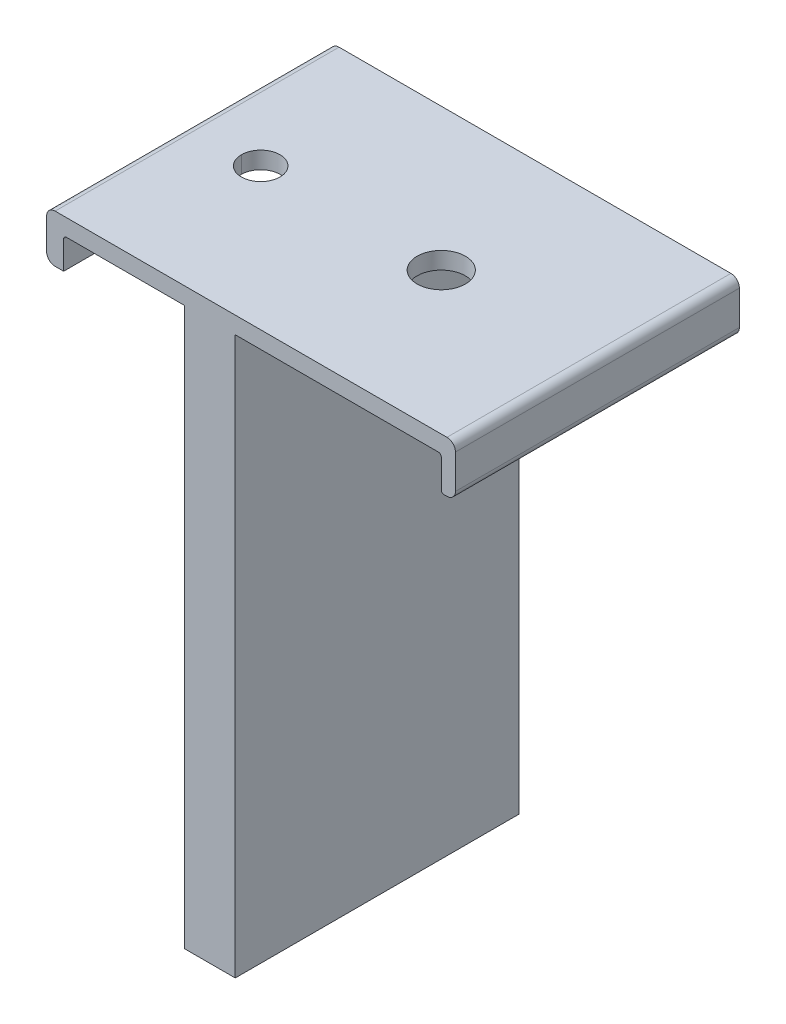
ISO-10303-21;
HEADER;
FILE_DESCRIPTION(('STEP AP214'),'2;1');
FILE_NAME('part.step','',(''),(''),'','','');
FILE_SCHEMA(('AUTOMOTIVE_DESIGN { 1 0 10303 214 1 1 1 1 }'));
ENDSEC;
DATA;
#1=APPLICATION_CONTEXT('core data for automotive mechanical design processes');
#2=APPLICATION_PROTOCOL_DEFINITION('international standard','automotive_design',2000,#1);
#3=PRODUCT_CONTEXT('',#1,'mechanical');
#4=PRODUCT('Part','Part','',(#3));
#5=PRODUCT_RELATED_PRODUCT_CATEGORY('part','',(#4));
#6=PRODUCT_DEFINITION_FORMATION('','',#4);
#7=PRODUCT_DEFINITION_CONTEXT('part definition',#1,'design');
#8=PRODUCT_DEFINITION('design','',#6,#7);
#9=PRODUCT_DEFINITION_SHAPE('','',#8);
#10=(LENGTH_UNIT() NAMED_UNIT(*) SI_UNIT(.MILLI.,.METRE.));
#11=(NAMED_UNIT(*) PLANE_ANGLE_UNIT() SI_UNIT($,.RADIAN.));
#12=(NAMED_UNIT(*) SI_UNIT($,.STERADIAN.) SOLID_ANGLE_UNIT());
#13=UNCERTAINTY_MEASURE_WITH_UNIT(LENGTH_MEASURE(1.E-05),#10,'distance_accuracy_value','');
#14=(GEOMETRIC_REPRESENTATION_CONTEXT(3) GLOBAL_UNCERTAINTY_ASSIGNED_CONTEXT((#13)) GLOBAL_UNIT_ASSIGNED_CONTEXT((#10,
#11,#12)) REPRESENTATION_CONTEXT('',''));
#15=CARTESIAN_POINT('',(0.,0.,0.));
#16=DIRECTION('',(0.,0.,1.));
#17=DIRECTION('',(1.,0.,0.));
#18=AXIS2_PLACEMENT_3D('',#15,#16,#17);
#19=CARTESIAN_POINT('',(0.520000000000034,-53.86,-25.));
#20=DIRECTION('',(1.,0.,0.));
#21=DIRECTION('',(0.,0.,-1.));
#22=AXIS2_PLACEMENT_3D('',#19,#20,#21);
#23=PLANE('',#22);
#24=DIRECTION('',(0.,1.,0.));
#25=VECTOR('',#24,1.);
#26=CARTESIAN_POINT('',(0.520000000000034,-53.86,-25.));
#27=LINE('',#26,#25);
#28=CARTESIAN_POINT('',(0.520000000000034,-98.1,-25.));
#29=VERTEX_POINT('',#28);
#30=CARTESIAN_POINT('',(0.520000000000034,0.,-25.));
#31=VERTEX_POINT('',#30);
#32=EDGE_CURVE('E167',#29,#31,#27,.T.);
#33=ORIENTED_EDGE('',*,*,#32,.T.);
#34=DIRECTION('',(0.,0.,1.));
#35=VECTOR('',#34,1.);
#36=CARTESIAN_POINT('',(0.520000000000034,0.,-25.));
#37=LINE('',#36,#35);
#38=CARTESIAN_POINT('',(0.520000000000034,0.,25.));
#39=VERTEX_POINT('',#38);
#40=EDGE_CURVE('E336',#31,#39,#37,.T.);
#41=ORIENTED_EDGE('',*,*,#40,.T.);
#42=DIRECTION('',(0.,1.,0.));
#43=VECTOR('',#42,1.);
#44=CARTESIAN_POINT('',(0.520000000000034,-53.86,25.));
#45=LINE('',#44,#43);
#46=CARTESIAN_POINT('',(0.520000000000034,-98.1,25.));
#47=VERTEX_POINT('',#46);
#48=EDGE_CURVE('E31',#39,#47,#45,.F.);
#49=ORIENTED_EDGE('',*,*,#48,.T.);
#50=DIRECTION('',(0.,0.,1.));
#51=VECTOR('',#50,1.);
#52=CARTESIAN_POINT('',(0.520000000000034,-98.1,-25.));
#53=LINE('',#52,#51);
#54=EDGE_CURVE('E573',#29,#47,#53,.T.);
#55=ORIENTED_EDGE('',*,*,#54,.F.);
#56=EDGE_LOOP('',(#33,#41,#49,#55));
#57=FACE_BOUND('',#56,.T.);
#58=ADVANCED_FACE('F15',(#57),#23,.T.);
#59=CARTESIAN_POINT('',(-8.45,-71.25,25.));
#60=DIRECTION('',(-1.,0.,0.));
#61=DIRECTION('',(0.,0.,1.));
#62=AXIS2_PLACEMENT_3D('',#59,#60,#61);
#63=PLANE('',#62);
#64=DIRECTION('',(0.,1.,0.));
#65=VECTOR('',#64,1.);
#66=CARTESIAN_POINT('',(-8.45,-71.25,25.));
#67=LINE('',#66,#65);
#68=CARTESIAN_POINT('',(-8.45,-98.1,25.));
#69=VERTEX_POINT('',#68);
#70=CARTESIAN_POINT('',(-8.45,0.,25.));
#71=VERTEX_POINT('',#70);
#72=EDGE_CURVE('E147',#69,#71,#67,.T.);
#73=ORIENTED_EDGE('',*,*,#72,.T.);
#74=DIRECTION('',(0.,0.,1.));
#75=VECTOR('',#74,1.);
#76=CARTESIAN_POINT('',(-8.45,0.,-25.));
#77=LINE('',#76,#75);
#78=CARTESIAN_POINT('',(-8.45,0.,-25.));
#79=VERTEX_POINT('',#78);
#80=EDGE_CURVE('E331',#79,#71,#77,.T.);
#81=ORIENTED_EDGE('',*,*,#80,.F.);
#82=DIRECTION('',(0.,1.,0.));
#83=VECTOR('',#82,1.);
#84=CARTESIAN_POINT('',(-8.45,-71.25,-25.));
#85=LINE('',#84,#83);
#86=CARTESIAN_POINT('',(-8.45,-98.1,-25.));
#87=VERTEX_POINT('',#86);
#88=EDGE_CURVE('E164',#79,#87,#85,.F.);
#89=ORIENTED_EDGE('',*,*,#88,.T.);
#90=DIRECTION('',(0.,0.,1.));
#91=VECTOR('',#90,1.);
#92=CARTESIAN_POINT('',(-8.45,-98.1,-25.));
#93=LINE('',#92,#91);
#94=EDGE_CURVE('E339',#87,#69,#93,.T.);
#95=ORIENTED_EDGE('',*,*,#94,.T.);
#96=EDGE_LOOP('',(#73,#81,#89,#95));
#97=FACE_BOUND('',#96,.T.);
#98=ADVANCED_FACE('F550',(#97),#63,.T.);
#99=CARTESIAN_POINT('',(37.3,-5.5,25.20937806158));
#100=DIRECTION('',(0.,0.,-1.));
#101=DIRECTION('',(-1.,0.,0.));
#102=AXIS2_PLACEMENT_3D('',#99,#100,#101);
#103=CYLINDRICAL_SURFACE('',#102,0.5);
#104=CARTESIAN_POINT('',(37.3,-5.5,25.));
#105=DIRECTION('',(0.,0.,-1.));
#106=DIRECTION('',(-1.,0.,0.));
#107=AXIS2_PLACEMENT_3D('',#104,#105,#106);
#108=CIRCLE('',#107,0.5);
#109=CARTESIAN_POINT('',(37.3,-5.99999999999978,25.));
#110=VERTEX_POINT('',#109);
#111=CARTESIAN_POINT('',(36.8,-5.5,25.));
#112=VERTEX_POINT('',#111);
#113=EDGE_CURVE('E146',#110,#112,#108,.T.);
#114=ORIENTED_EDGE('',*,*,#113,.T.);
#115=DIRECTION('',(0.,0.,1.));
#116=VECTOR('',#115,1.);
#117=CARTESIAN_POINT('',(36.8,-5.5,-25.));
#118=LINE('',#117,#116);
#119=CARTESIAN_POINT('',(36.8,-5.5,-25.));
#120=VERTEX_POINT('',#119);
#121=EDGE_CURVE('E142',#120,#112,#118,.T.);
#122=ORIENTED_EDGE('',*,*,#121,.F.);
#123=CARTESIAN_POINT('',(37.3,-5.5,-25.));
#124=DIRECTION('',(0.,0.,-1.));
#125=DIRECTION('',(-1.,0.,0.));
#126=AXIS2_PLACEMENT_3D('',#123,#124,#125);
#127=CIRCLE('',#126,0.5);
#128=CARTESIAN_POINT('',(37.3,-5.99999999999978,-25.));
#129=VERTEX_POINT('',#128);
#130=EDGE_CURVE('E18',#120,#129,#127,.F.);
#131=ORIENTED_EDGE('',*,*,#130,.T.);
#132=DIRECTION('',(0.,0.,-1.));
#133=VECTOR('',#132,1.);
#134=CARTESIAN_POINT('',(37.3,-5.99999999999978,-25.));
#135=LINE('',#134,#133);
#136=EDGE_CURVE('E139',#110,#129,#135,.T.);
#137=ORIENTED_EDGE('',*,*,#136,.F.);
#138=EDGE_LOOP('',(#114,#122,#131,#137));
#139=FACE_BOUND('',#138,.T.);
#140=ADVANCED_FACE('F137',(#139),#103,.T.);
#141=CARTESIAN_POINT('',(36.8,-5.99999999999978,-25.));
#142=DIRECTION('',(0.,-1.,0.));
#143=DIRECTION('',(0.,0.,-1.));
#144=AXIS2_PLACEMENT_3D('',#141,#142,#143);
#145=PLANE('',#144);
#146=DIRECTION('',(1.,0.,0.));
#147=VECTOR('',#146,1.);
#148=CARTESIAN_POINT('',(36.8,-5.99999999999978,-25.));
#149=LINE('',#148,#147);
#150=CARTESIAN_POINT('',(37.8,-5.99999999999978,-25.));
#151=VERTEX_POINT('',#150);
#152=EDGE_CURVE('E149',#129,#151,#149,.T.);
#153=ORIENTED_EDGE('',*,*,#152,.T.);
#154=DIRECTION('',(0.,0.,-1.));
#155=VECTOR('',#154,1.);
#156=CARTESIAN_POINT('',(37.8,-5.99999999999978,25.20937806158));
#157=LINE('',#156,#155);
#158=CARTESIAN_POINT('',(37.8,-5.99999999999978,25.));
#159=VERTEX_POINT('',#158);
#160=EDGE_CURVE('E227',#159,#151,#157,.T.);
#161=ORIENTED_EDGE('',*,*,#160,.F.);
#162=DIRECTION('',(1.,0.,0.));
#163=VECTOR('',#162,1.);
#164=CARTESIAN_POINT('',(36.8,-5.99999999999978,25.));
#165=LINE('',#164,#163);
#166=EDGE_CURVE('E160',#159,#110,#165,.F.);
#167=ORIENTED_EDGE('',*,*,#166,.T.);
#168=ORIENTED_EDGE('',*,*,#136,.T.);
#169=EDGE_LOOP('',(#153,#161,#167,#168));
#170=FACE_BOUND('',#169,.T.);
#171=ADVANCED_FACE('F159',(#170),#145,.T.);
#172=CARTESIAN_POINT('',(36.3,-0.499999999999723,-25.17890263514));
#173=DIRECTION('',(0.,0.,1.));
#174=DIRECTION('',(1.,0.,0.));
#175=AXIS2_PLACEMENT_3D('',#172,#173,#174);
#176=CYLINDRICAL_SURFACE('',#175,0.5);
#177=DIRECTION('',(0.,0.,-1.));
#178=VECTOR('',#177,1.);
#179=CARTESIAN_POINT('',(36.3,0.,-25.));
#180=LINE('',#179,#178);
#181=CARTESIAN_POINT('',(36.3,0.,-25.));
#182=VERTEX_POINT('',#181);
#183=CARTESIAN_POINT('',(36.3,0.,25.));
#184=VERTEX_POINT('',#183);
#185=EDGE_CURVE('E285',#182,#184,#180,.F.);
#186=ORIENTED_EDGE('',*,*,#185,.F.);
#187=CARTESIAN_POINT('',(36.3,-0.499999999999723,-25.));
#188=DIRECTION('',(0.,0.,1.));
#189=DIRECTION('',(1.,0.,0.));
#190=AXIS2_PLACEMENT_3D('',#187,#188,#189);
#191=CIRCLE('',#190,0.5);
#192=CARTESIAN_POINT('',(36.8,-0.499999999999723,-25.));
#193=VERTEX_POINT('',#192);
#194=EDGE_CURVE('E157',#193,#182,#191,.T.);
#195=ORIENTED_EDGE('',*,*,#194,.F.);
#196=DIRECTION('',(0.,0.,1.));
#197=VECTOR('',#196,1.);
#198=CARTESIAN_POINT('',(36.8,-0.499999999999723,-25.));
#199=LINE('',#198,#197);
#200=CARTESIAN_POINT('',(36.8,-0.499999999999723,25.));
#201=VERTEX_POINT('',#200);
#202=EDGE_CURVE('E228',#201,#193,#199,.F.);
#203=ORIENTED_EDGE('',*,*,#202,.F.);
#204=CARTESIAN_POINT('',(36.3,-0.499999999999723,25.));
#205=DIRECTION('',(0.,0.,1.));
#206=DIRECTION('',(1.,0.,0.));
#207=AXIS2_PLACEMENT_3D('',#204,#205,#206);
#208=CIRCLE('',#207,0.5);
#209=EDGE_CURVE('E219',#184,#201,#208,.F.);
#210=ORIENTED_EDGE('',*,*,#209,.F.);
#211=EDGE_LOOP('',(#186,#195,#203,#210));
#212=FACE_BOUND('',#211,.T.);
#213=ADVANCED_FACE('F524',(#212),#176,.F.);
#214=CARTESIAN_POINT('',(-29.2,-0.500000000000167,-25.17890263514));
#215=DIRECTION('',(0.,0.,1.));
#216=DIRECTION('',(1.,0.,0.));
#217=AXIS2_PLACEMENT_3D('',#214,#215,#216);
#218=CYLINDRICAL_SURFACE('',#217,0.5);
#219=DIRECTION('',(0.,0.,-1.));
#220=VECTOR('',#219,1.);
#221=CARTESIAN_POINT('',(-29.7,-0.500000000000167,-25.));
#222=LINE('',#221,#220);
#223=CARTESIAN_POINT('',(-29.7,-0.500000000000167,-25.));
#224=VERTEX_POINT('',#223);
#225=CARTESIAN_POINT('',(-29.7,-0.500000000000167,25.));
#226=VERTEX_POINT('',#225);
#227=EDGE_CURVE('E215',#224,#226,#222,.F.);
#228=ORIENTED_EDGE('',*,*,#227,.F.);
#229=CARTESIAN_POINT('',(-29.2,-0.500000000000167,-25.));
#230=DIRECTION('',(0.,0.,1.));
#231=DIRECTION('',(1.,0.,0.));
#232=AXIS2_PLACEMENT_3D('',#229,#230,#231);
#233=CIRCLE('',#232,0.5);
#234=CARTESIAN_POINT('',(-29.2,0.,-25.));
#235=VERTEX_POINT('',#234);
#236=EDGE_CURVE('E216',#235,#224,#233,.T.);
#237=ORIENTED_EDGE('',*,*,#236,.F.);
#238=DIRECTION('',(0.,0.,-1.));
#239=VECTOR('',#238,1.);
#240=CARTESIAN_POINT('',(-29.2,0.,-25.));
#241=LINE('',#240,#239);
#242=CARTESIAN_POINT('',(-29.2,0.,25.));
#243=VERTEX_POINT('',#242);
#244=EDGE_CURVE('E272',#243,#235,#241,.T.);
#245=ORIENTED_EDGE('',*,*,#244,.F.);
#246=CARTESIAN_POINT('',(-29.2,-0.500000000000167,25.));
#247=DIRECTION('',(0.,0.,1.));
#248=DIRECTION('',(1.,0.,0.));
#249=AXIS2_PLACEMENT_3D('',#246,#247,#248);
#250=CIRCLE('',#249,0.5);
#251=EDGE_CURVE('E213',#226,#243,#250,.F.);
#252=ORIENTED_EDGE('',*,*,#251,.F.);
#253=EDGE_LOOP('',(#228,#237,#245,#252));
#254=FACE_BOUND('',#253,.T.);
#255=ADVANCED_FACE('F303',(#254),#218,.F.);
#256=CARTESIAN_POINT('',(-29.7,-2.80000000000013,-25.));
#257=DIRECTION('',(1.,0.,0.));
#258=DIRECTION('',(0.,0.,-1.));
#259=AXIS2_PLACEMENT_3D('',#256,#257,#258);
#260=PLANE('',#259);
#261=ORIENTED_EDGE('',*,*,#227,.T.);
#262=DIRECTION('',(0.,1.,0.));
#263=VECTOR('',#262,1.);
#264=CARTESIAN_POINT('',(-29.7,0.,25.));
#265=LINE('',#264,#263);
#266=CARTESIAN_POINT('',(-29.7,-5.43,25.));
#267=VERTEX_POINT('',#266);
#268=EDGE_CURVE('E244',#267,#226,#265,.T.);
#269=ORIENTED_EDGE('',*,*,#268,.F.);
#270=DIRECTION('',(0.,0.,-1.));
#271=VECTOR('',#270,1.);
#272=CARTESIAN_POINT('',(-29.7,-5.43,-25.));
#273=LINE('',#272,#271);
#274=CARTESIAN_POINT('',(-29.7,-5.43,-25.));
#275=VERTEX_POINT('',#274);
#276=EDGE_CURVE('E329',#267,#275,#273,.T.);
#277=ORIENTED_EDGE('',*,*,#276,.T.);
#278=DIRECTION('',(0.,1.,0.));
#279=VECTOR('',#278,1.);
#280=CARTESIAN_POINT('',(-29.7,0.,-25.));
#281=LINE('',#280,#279);
#282=EDGE_CURVE('E270',#275,#224,#281,.T.);
#283=ORIENTED_EDGE('',*,*,#282,.T.);
#284=EDGE_LOOP('',(#261,#269,#277,#283));
#285=FACE_BOUND('',#284,.T.);
#286=ADVANCED_FACE('F296',(#285),#260,.T.);
#287=CARTESIAN_POINT('',(-4.6,-98.1,-25.));
#288=DIRECTION('',(0.,-1.,0.));
#289=DIRECTION('',(0.,0.,-1.));
#290=AXIS2_PLACEMENT_3D('',#287,#288,#289);
#291=PLANE('',#290);
#292=DIRECTION('',(1.,0.,0.));
#293=VECTOR('',#292,1.);
#294=CARTESIAN_POINT('',(0.,-98.1,25.));
#295=LINE('',#294,#293);
#296=EDGE_CURVE('E235',#69,#47,#295,.T.);
#297=ORIENTED_EDGE('',*,*,#296,.F.);
#298=ORIENTED_EDGE('',*,*,#94,.F.);
#299=DIRECTION('',(1.,0.,0.));
#300=VECTOR('',#299,1.);
#301=CARTESIAN_POINT('',(0.,-98.1,-25.));
#302=LINE('',#301,#300);
#303=EDGE_CURVE('E264',#87,#29,#302,.T.);
#304=ORIENTED_EDGE('',*,*,#303,.T.);
#305=ORIENTED_EDGE('',*,*,#54,.T.);
#306=EDGE_LOOP('',(#297,#298,#304,#305));
#307=FACE_BOUND('',#306,.T.);
#308=ADVANCED_FACE('F497',(#307),#291,.T.);
#309=CARTESIAN_POINT('',(36.8,0.,-25.));
#310=DIRECTION('',(-1.,0.,0.));
#311=DIRECTION('',(0.,0.,1.));
#312=AXIS2_PLACEMENT_3D('',#309,#310,#311);
#313=PLANE('',#312);
#314=DIRECTION('',(0.,1.,0.));
#315=VECTOR('',#314,1.);
#316=CARTESIAN_POINT('',(36.8,0.,-25.));
#317=LINE('',#316,#315);
#318=EDGE_CURVE('E212',#193,#120,#317,.F.);
#319=ORIENTED_EDGE('',*,*,#318,.T.);
#320=ORIENTED_EDGE('',*,*,#121,.T.);
#321=DIRECTION('',(0.,1.,0.));
#322=VECTOR('',#321,1.);
#323=CARTESIAN_POINT('',(36.8,0.,25.));
#324=LINE('',#323,#322);
#325=EDGE_CURVE('E201',#201,#112,#324,.F.);
#326=ORIENTED_EDGE('',*,*,#325,.F.);
#327=ORIENTED_EDGE('',*,*,#202,.T.);
#328=EDGE_LOOP('',(#319,#320,#326,#327));
#329=FACE_BOUND('',#328,.T.);
#330=ADVANCED_FACE('F225',(#329),#313,.T.);
#331=CARTESIAN_POINT('',(37.8,-4.49999999999972,25.20937806158));
#332=DIRECTION('',(0.,0.,-1.));
#333=DIRECTION('',(-1.,0.,0.));
#334=AXIS2_PLACEMENT_3D('',#331,#332,#333);
#335=CYLINDRICAL_SURFACE('',#334,1.5);
#336=ORIENTED_EDGE('',*,*,#160,.T.);
#337=CARTESIAN_POINT('',(37.8,-4.49999999999972,-25.));
#338=DIRECTION('',(0.,0.,-1.));
#339=DIRECTION('',(-1.,0.,0.));
#340=AXIS2_PLACEMENT_3D('',#337,#338,#339);
#341=CIRCLE('',#340,1.5);
#342=CARTESIAN_POINT('',(39.3,-4.49999999999972,-25.));
#343=VERTEX_POINT('',#342);
#344=EDGE_CURVE('E153',#151,#343,#341,.F.);
#345=ORIENTED_EDGE('',*,*,#344,.T.);
#346=DIRECTION('',(0.,0.,-1.));
#347=VECTOR('',#346,1.);
#348=CARTESIAN_POINT('',(39.3,-4.49999999999972,-25.));
#349=LINE('',#348,#347);
#350=CARTESIAN_POINT('',(39.3,-4.49999999999972,25.));
#351=VERTEX_POINT('',#350);
#352=EDGE_CURVE('E278',#351,#343,#349,.T.);
#353=ORIENTED_EDGE('',*,*,#352,.F.);
#354=CARTESIAN_POINT('',(37.8,-4.49999999999972,25.));
#355=DIRECTION('',(0.,0.,-1.));
#356=DIRECTION('',(-1.,0.,0.));
#357=AXIS2_PLACEMENT_3D('',#354,#355,#356);
#358=CIRCLE('',#357,1.5);
#359=EDGE_CURVE('E198',#159,#351,#358,.F.);
#360=ORIENTED_EDGE('',*,*,#359,.F.);
#361=EDGE_LOOP('',(#336,#345,#353,#360));
#362=FACE_BOUND('',#361,.T.);
#363=ADVANCED_FACE('F479',(#362),#335,.T.);
#364=CARTESIAN_POINT('',(-32.7,2.99999999999967,-25.));
#365=DIRECTION('',(-1.,0.,0.));
#366=DIRECTION('',(0.,0.,1.));
#367=AXIS2_PLACEMENT_3D('',#364,#365,#366);
#368=PLANE('',#367);
#369=DIRECTION('',(0.,1.,0.));
#370=VECTOR('',#369,1.);
#371=CARTESIAN_POINT('',(-32.7,0.,25.));
#372=LINE('',#371,#370);
#373=CARTESIAN_POINT('',(-32.7,1.50000000000006,25.));
#374=VERTEX_POINT('',#373);
#375=CARTESIAN_POINT('',(-32.7,-3.93,25.));
#376=VERTEX_POINT('',#375);
#377=EDGE_CURVE('E193',#374,#376,#372,.F.);
#378=ORIENTED_EDGE('',*,*,#377,.F.);
#379=DIRECTION('',(0.,0.,-1.));
#380=VECTOR('',#379,1.);
#381=CARTESIAN_POINT('',(-32.7,1.50000000000006,25.20937806158));
#382=LINE('',#381,#380);
#383=CARTESIAN_POINT('',(-32.7,1.50000000000006,-25.));
#384=VERTEX_POINT('',#383);
#385=EDGE_CURVE('E205',#384,#374,#382,.F.);
#386=ORIENTED_EDGE('',*,*,#385,.F.);
#387=DIRECTION('',(0.,1.,0.));
#388=VECTOR('',#387,1.);
#389=CARTESIAN_POINT('',(-32.7,0.,-25.));
#390=LINE('',#389,#388);
#391=CARTESIAN_POINT('',(-32.7,-3.93,-25.));
#392=VERTEX_POINT('',#391);
#393=EDGE_CURVE('E209',#384,#392,#390,.F.);
#394=ORIENTED_EDGE('',*,*,#393,.T.);
#395=DIRECTION('',(0.,0.,-1.));
#396=VECTOR('',#395,1.);
#397=CARTESIAN_POINT('',(-32.7,-3.93,25.20937806158));
#398=LINE('',#397,#396);
#399=EDGE_CURVE('E279',#376,#392,#398,.T.);
#400=ORIENTED_EDGE('',*,*,#399,.F.);
#401=EDGE_LOOP('',(#378,#386,#394,#400));
#402=FACE_BOUND('',#401,.T.);
#403=ADVANCED_FACE('F322',(#402),#368,.T.);
#404=CARTESIAN_POINT('',(-31.2,-3.93,25.20937806158));
#405=DIRECTION('',(0.,0.,-1.));
#406=DIRECTION('',(-1.,0.,0.));
#407=AXIS2_PLACEMENT_3D('',#404,#405,#406);
#408=CYLINDRICAL_SURFACE('',#407,1.5);
#409=CARTESIAN_POINT('',(-31.2,-3.93,25.));
#410=DIRECTION('',(0.,0.,-1.));
#411=DIRECTION('',(-1.,0.,0.));
#412=AXIS2_PLACEMENT_3D('',#409,#410,#411);
#413=CIRCLE('',#412,1.5);
#414=CARTESIAN_POINT('',(-31.2,-5.43,25.));
#415=VERTEX_POINT('',#414);
#416=EDGE_CURVE('E190',#376,#415,#413,.F.);
#417=ORIENTED_EDGE('',*,*,#416,.F.);
#418=ORIENTED_EDGE('',*,*,#399,.T.);
#419=CARTESIAN_POINT('',(-31.2,-3.93,-25.));
#420=DIRECTION('',(0.,0.,-1.));
#421=DIRECTION('',(-1.,0.,0.));
#422=AXIS2_PLACEMENT_3D('',#419,#420,#421);
#423=CIRCLE('',#422,1.5);
#424=CARTESIAN_POINT('',(-31.2,-5.43,-25.));
#425=VERTEX_POINT('',#424);
#426=EDGE_CURVE('E207',#392,#425,#423,.F.);
#427=ORIENTED_EDGE('',*,*,#426,.T.);
#428=DIRECTION('',(0.,0.,-1.));
#429=VECTOR('',#428,1.);
#430=CARTESIAN_POINT('',(-31.2,-5.43,-25.));
#431=LINE('',#430,#429);
#432=EDGE_CURVE('E275',#415,#425,#431,.T.);
#433=ORIENTED_EDGE('',*,*,#432,.F.);
#434=EDGE_LOOP('',(#417,#418,#427,#433));
#435=FACE_BOUND('',#434,.T.);
#436=ADVANCED_FACE('F325',(#435),#408,.T.);
#437=CARTESIAN_POINT('',(-32.7,-5.43,-25.));
#438=DIRECTION('',(0.,-1.,0.));
#439=DIRECTION('',(0.,0.,-1.));
#440=AXIS2_PLACEMENT_3D('',#437,#438,#439);
#441=PLANE('',#440);
#442=ORIENTED_EDGE('',*,*,#276,.F.);
#443=DIRECTION('',(1.,0.,0.));
#444=VECTOR('',#443,1.);
#445=CARTESIAN_POINT('',(0.,-5.43,25.));
#446=LINE('',#445,#444);
#447=EDGE_CURVE('E189',#415,#267,#446,.T.);
#448=ORIENTED_EDGE('',*,*,#447,.F.);
#449=ORIENTED_EDGE('',*,*,#432,.T.);
#450=DIRECTION('',(1.,0.,0.));
#451=VECTOR('',#450,1.);
#452=CARTESIAN_POINT('',(0.,-5.43,-25.));
#453=LINE('',#452,#451);
#454=EDGE_CURVE('E206',#425,#275,#453,.T.);
#455=ORIENTED_EDGE('',*,*,#454,.T.);
#456=EDGE_LOOP('',(#442,#448,#449,#455));
#457=FACE_BOUND('',#456,.T.);
#458=ADVANCED_FACE('F327',(#457),#441,.T.);
#459=CARTESIAN_POINT('',(39.3,-5.99999999999978,-25.));
#460=DIRECTION('',(1.,0.,0.));
#461=DIRECTION('',(0.,0.,-1.));
#462=AXIS2_PLACEMENT_3D('',#459,#460,#461);
#463=PLANE('',#462);
#464=DIRECTION('',(0.,1.,0.));
#465=VECTOR('',#464,1.);
#466=CARTESIAN_POINT('',(39.3,0.,25.));
#467=LINE('',#466,#465);
#468=CARTESIAN_POINT('',(39.3,1.50000000000006,25.));
#469=VERTEX_POINT('',#468);
#470=EDGE_CURVE('E197',#351,#469,#467,.T.);
#471=ORIENTED_EDGE('',*,*,#470,.F.);
#472=ORIENTED_EDGE('',*,*,#352,.T.);
#473=DIRECTION('',(0.,1.,0.));
#474=VECTOR('',#473,1.);
#475=CARTESIAN_POINT('',(39.3,0.,-25.));
#476=LINE('',#475,#474);
#477=CARTESIAN_POINT('',(39.3,1.50000000000006,-25.));
#478=VERTEX_POINT('',#477);
#479=EDGE_CURVE('E211',#343,#478,#476,.T.);
#480=ORIENTED_EDGE('',*,*,#479,.T.);
#481=DIRECTION('',(0.,0.,-1.));
#482=VECTOR('',#481,1.);
#483=CARTESIAN_POINT('',(39.3,1.50000000000006,25.20937806158));
#484=LINE('',#483,#482);
#485=EDGE_CURVE('E182',#469,#478,#484,.T.);
#486=ORIENTED_EDGE('',*,*,#485,.F.);
#487=EDGE_LOOP('',(#471,#472,#480,#486));
#488=FACE_BOUND('',#487,.T.);
#489=ADVANCED_FACE('F351',(#488),#463,.T.);
#490=CARTESIAN_POINT('',(-0.8,0.,-25.));
#491=DIRECTION('',(0.,-1.,0.));
#492=DIRECTION('',(0.,0.,-1.));
#493=AXIS2_PLACEMENT_3D('',#490,#491,#492);
#494=PLANE('',#493);
#495=ORIENTED_EDGE('',*,*,#40,.F.);
#496=DIRECTION('',(1.,0.,0.));
#497=VECTOR('',#496,1.);
#498=CARTESIAN_POINT('',(0.,0.,-25.));
#499=LINE('',#498,#497);
#500=EDGE_CURVE('E262',#31,#182,#499,.T.);
#501=ORIENTED_EDGE('',*,*,#500,.T.);
#502=ORIENTED_EDGE('',*,*,#185,.T.);
#503=DIRECTION('',(1.,0.,0.));
#504=VECTOR('',#503,1.);
#505=CARTESIAN_POINT('',(0.,0.,25.));
#506=LINE('',#505,#504);
#507=EDGE_CURVE('E233',#39,#184,#506,.T.);
#508=ORIENTED_EDGE('',*,*,#507,.F.);
#509=EDGE_LOOP('',(#495,#501,#502,#508));
#510=FACE_BOUND('',#509,.T.);
#511=CARTESIAN_POINT('',(11.8,0.,0.));
#512=DIRECTION('',(0.,-1.,0.));
#513=DIRECTION('',(0.,0.,-1.));
#514=AXIS2_PLACEMENT_3D('',#511,#512,#513);
#515=CIRCLE('',#514,4.25);
#516=CARTESIAN_POINT('',(11.8,0.,-4.25));
#517=VERTEX_POINT('',#516);
#518=EDGE_CURVE('E171',#517,#517,#515,.T.);
#519=ORIENTED_EDGE('',*,*,#518,.F.);
#520=EDGE_LOOP('',(#519));
#521=FACE_BOUND('',#520,.T.);
#522=ADVANCED_FACE('F348',(#510,#521),#494,.T.);
#523=CARTESIAN_POINT('',(-29.7,0.,-25.));
#524=DIRECTION('',(0.,-1.,0.));
#525=DIRECTION('',(0.,0.,-1.));
#526=AXIS2_PLACEMENT_3D('',#523,#524,#525);
#527=PLANE('',#526);
#528=ORIENTED_EDGE('',*,*,#80,.T.);
#529=DIRECTION('',(1.,0.,0.));
#530=VECTOR('',#529,1.);
#531=CARTESIAN_POINT('',(0.,0.,25.));
#532=LINE('',#531,#530);
#533=EDGE_CURVE('E241',#243,#71,#532,.T.);
#534=ORIENTED_EDGE('',*,*,#533,.F.);
#535=ORIENTED_EDGE('',*,*,#244,.T.);
#536=DIRECTION('',(1.,0.,0.));
#537=VECTOR('',#536,1.);
#538=CARTESIAN_POINT('',(0.,0.,-25.));
#539=LINE('',#538,#537);
#540=EDGE_CURVE('E267',#235,#79,#539,.T.);
#541=ORIENTED_EDGE('',*,*,#540,.T.);
#542=EDGE_LOOP('',(#528,#534,#535,#541));
#543=FACE_BOUND('',#542,.T.);
#544=CARTESIAN_POINT('',(-20.,0.,0.));
#545=DIRECTION('',(0.,1.,0.));
#546=DIRECTION('',(0.,0.,1.));
#547=AXIS2_PLACEMENT_3D('',#544,#545,#546);
#548=CIRCLE('',#547,3.4);
#549=CARTESIAN_POINT('',(-23.4,0.,0.));
#550=VERTEX_POINT('',#549);
#551=CARTESIAN_POINT('',(-16.6,0.,0.));
#552=VERTEX_POINT('',#551);
#553=EDGE_CURVE('E180',#550,#552,#548,.T.);
#554=ORIENTED_EDGE('',*,*,#553,.T.);
#555=CARTESIAN_POINT('',(-20.,0.,0.));
#556=DIRECTION('',(0.,1.,0.));
#557=DIRECTION('',(0.,0.,1.));
#558=AXIS2_PLACEMENT_3D('',#555,#556,#557);
#559=CIRCLE('',#558,3.4);
#560=EDGE_CURVE('E177',#552,#550,#559,.T.);
#561=ORIENTED_EDGE('',*,*,#560,.T.);
#562=EDGE_LOOP('',(#554,#561));
#563=FACE_BOUND('',#562,.T.);
#564=ADVANCED_FACE('F350',(#543,#563),#527,.T.);
#565=CARTESIAN_POINT('',(0.,0.,-25.));
#566=DIRECTION('',(0.,0.,1.));
#567=DIRECTION('',(1.,0.,0.));
#568=AXIS2_PLACEMENT_3D('',#565,#566,#567);
#569=PLANE('',#568);
#570=ORIENTED_EDGE('',*,*,#32,.F.);
#571=ORIENTED_EDGE('',*,*,#303,.F.);
#572=ORIENTED_EDGE('',*,*,#88,.F.);
#573=ORIENTED_EDGE('',*,*,#540,.F.);
#574=ORIENTED_EDGE('',*,*,#236,.T.);
#575=ORIENTED_EDGE('',*,*,#282,.F.);
#576=ORIENTED_EDGE('',*,*,#454,.F.);
#577=ORIENTED_EDGE('',*,*,#426,.F.);
#578=ORIENTED_EDGE('',*,*,#393,.F.);
#579=CARTESIAN_POINT('',(-31.2,1.50000000000006,-25.));
#580=DIRECTION('',(0.,0.,-1.));
#581=DIRECTION('',(-1.,0.,0.));
#582=AXIS2_PLACEMENT_3D('',#579,#580,#581);
#583=CIRCLE('',#582,1.5);
#584=CARTESIAN_POINT('',(-31.2,2.99999999999967,-25.));
#585=VERTEX_POINT('',#584);
#586=EDGE_CURVE('E202',#585,#384,#583,.F.);
#587=ORIENTED_EDGE('',*,*,#586,.F.);
#588=DIRECTION('',(1.,0.,0.));
#589=VECTOR('',#588,1.);
#590=CARTESIAN_POINT('',(39.3,3.00000000000012,-25.));
#591=LINE('',#590,#589);
#592=CARTESIAN_POINT('',(37.8,3.00000000000012,-25.));
#593=VERTEX_POINT('',#592);
#594=EDGE_CURVE('E250',#593,#585,#591,.F.);
#595=ORIENTED_EDGE('',*,*,#594,.F.);
#596=CARTESIAN_POINT('',(37.8,1.50000000000006,-25.));
#597=DIRECTION('',(0.,0.,-1.));
#598=DIRECTION('',(-1.,0.,0.));
#599=AXIS2_PLACEMENT_3D('',#596,#597,#598);
#600=CIRCLE('',#599,1.5);
#601=EDGE_CURVE('E186',#478,#593,#600,.F.);
#602=ORIENTED_EDGE('',*,*,#601,.F.);
#603=ORIENTED_EDGE('',*,*,#479,.F.);
#604=ORIENTED_EDGE('',*,*,#344,.F.);
#605=ORIENTED_EDGE('',*,*,#152,.F.);
#606=ORIENTED_EDGE('',*,*,#130,.F.);
#607=ORIENTED_EDGE('',*,*,#318,.F.);
#608=ORIENTED_EDGE('',*,*,#194,.T.);
#609=ORIENTED_EDGE('',*,*,#500,.F.);
#610=EDGE_LOOP('',(#570,#571,#572,#573,#574,#575,#576,#577,#578,#587,#595,#602,#603,#604,#605,
#606,#607,#608,#609));
#611=FACE_BOUND('',#610,.T.);
#612=ADVANCED_FACE('F151',(#611),#569,.F.);
#613=CARTESIAN_POINT('',(-31.2,1.50000000000006,25.20937806158));
#614=DIRECTION('',(0.,0.,-1.));
#615=DIRECTION('',(-1.,0.,0.));
#616=AXIS2_PLACEMENT_3D('',#613,#614,#615);
#617=CYLINDRICAL_SURFACE('',#616,1.5);
#618=CARTESIAN_POINT('',(-31.2,1.50000000000006,25.));
#619=DIRECTION('',(0.,0.,-1.));
#620=DIRECTION('',(-1.,0.,0.));
#621=AXIS2_PLACEMENT_3D('',#618,#619,#620);
#622=CIRCLE('',#621,1.5);
#623=CARTESIAN_POINT('',(-31.2,2.99999999999967,25.));
#624=VERTEX_POINT('',#623);
#625=EDGE_CURVE('E194',#624,#374,#622,.F.);
#626=ORIENTED_EDGE('',*,*,#625,.F.);
#627=DIRECTION('',(0.,0.,1.));
#628=VECTOR('',#627,1.);
#629=CARTESIAN_POINT('',(-31.2,2.99999999999967,-25.));
#630=LINE('',#629,#628);
#631=EDGE_CURVE('E246',#585,#624,#630,.T.);
#632=ORIENTED_EDGE('',*,*,#631,.F.);
#633=ORIENTED_EDGE('',*,*,#586,.T.);
#634=ORIENTED_EDGE('',*,*,#385,.T.);
#635=EDGE_LOOP('',(#626,#632,#633,#634));
#636=FACE_BOUND('',#635,.T.);
#637=ADVANCED_FACE('F390',(#636),#617,.T.);
#638=CARTESIAN_POINT('',(0.,0.,25.));
#639=DIRECTION('',(0.,0.,1.));
#640=DIRECTION('',(1.,0.,0.));
#641=AXIS2_PLACEMENT_3D('',#638,#639,#640);
#642=PLANE('',#641);
#643=ORIENTED_EDGE('',*,*,#296,.T.);
#644=ORIENTED_EDGE('',*,*,#48,.F.);
#645=ORIENTED_EDGE('',*,*,#507,.T.);
#646=ORIENTED_EDGE('',*,*,#209,.T.);
#647=ORIENTED_EDGE('',*,*,#325,.T.);
#648=ORIENTED_EDGE('',*,*,#113,.F.);
#649=ORIENTED_EDGE('',*,*,#166,.F.);
#650=ORIENTED_EDGE('',*,*,#359,.T.);
#651=ORIENTED_EDGE('',*,*,#470,.T.);
#652=CARTESIAN_POINT('',(37.8,1.50000000000006,25.));
#653=DIRECTION('',(0.,0.,-1.));
#654=DIRECTION('',(-1.,0.,0.));
#655=AXIS2_PLACEMENT_3D('',#652,#653,#654);
#656=CIRCLE('',#655,1.5);
#657=CARTESIAN_POINT('',(37.8,3.00000000000012,25.));
#658=VERTEX_POINT('',#657);
#659=EDGE_CURVE('E183',#658,#469,#656,.T.);
#660=ORIENTED_EDGE('',*,*,#659,.F.);
#661=DIRECTION('',(1.,0.,0.));
#662=VECTOR('',#661,1.);
#663=CARTESIAN_POINT('',(39.3,3.00000000000012,25.));
#664=LINE('',#663,#662);
#665=EDGE_CURVE('E249',#624,#658,#664,.T.);
#666=ORIENTED_EDGE('',*,*,#665,.F.);
#667=ORIENTED_EDGE('',*,*,#625,.T.);
#668=ORIENTED_EDGE('',*,*,#377,.T.);
#669=ORIENTED_EDGE('',*,*,#416,.T.);
#670=ORIENTED_EDGE('',*,*,#447,.T.);
#671=ORIENTED_EDGE('',*,*,#268,.T.);
#672=ORIENTED_EDGE('',*,*,#251,.T.);
#673=ORIENTED_EDGE('',*,*,#533,.T.);
#674=ORIENTED_EDGE('',*,*,#72,.F.);
#675=EDGE_LOOP('',(#643,#644,#645,#646,#647,#648,#649,#650,#651,#660,#666,#667,#668,#669,#670,
#671,#672,#673,#674));
#676=FACE_BOUND('',#675,.T.);
#677=ADVANCED_FACE('F230',(#676),#642,.T.);
#678=CARTESIAN_POINT('',(37.8,1.50000000000006,25.20937806158));
#679=DIRECTION('',(0.,0.,-1.));
#680=DIRECTION('',(-1.,0.,0.));
#681=AXIS2_PLACEMENT_3D('',#678,#679,#680);
#682=CYLINDRICAL_SURFACE('',#681,1.5);
#683=ORIENTED_EDGE('',*,*,#659,.T.);
#684=ORIENTED_EDGE('',*,*,#485,.T.);
#685=ORIENTED_EDGE('',*,*,#601,.T.);
#686=DIRECTION('',(0.,0.,1.));
#687=VECTOR('',#686,1.);
#688=CARTESIAN_POINT('',(37.8,3.00000000000012,-25.));
#689=LINE('',#688,#687);
#690=EDGE_CURVE('E176',#658,#593,#689,.F.);
#691=ORIENTED_EDGE('',*,*,#690,.F.);
#692=EDGE_LOOP('',(#683,#684,#685,#691));
#693=FACE_BOUND('',#692,.T.);
#694=ADVANCED_FACE('F384',(#693),#682,.T.);
#695=CARTESIAN_POINT('',(-20.,2.99999999999967,0.));
#696=DIRECTION('',(0.,1.,0.));
#697=DIRECTION('',(0.,0.,1.));
#698=AXIS2_PLACEMENT_3D('',#695,#696,#697);
#699=CYLINDRICAL_SURFACE('',#698,3.4);
#700=ORIENTED_EDGE('',*,*,#553,.F.);
#701=DIRECTION('',(0.,1.,0.));
#702=VECTOR('',#701,1.);
#703=CARTESIAN_POINT('',(-23.4,2.99999999999967,0.));
#704=LINE('',#703,#702);
#705=CARTESIAN_POINT('',(-23.4,2.99999999999967,0.));
#706=VERTEX_POINT('',#705);
#707=EDGE_CURVE('E40',#550,#706,#704,.T.);
#708=ORIENTED_EDGE('',*,*,#707,.T.);
#709=CARTESIAN_POINT('',(-20.,2.99999999999967,0.));
#710=DIRECTION('',(0.,1.,0.));
#711=DIRECTION('',(0.,0.,1.));
#712=AXIS2_PLACEMENT_3D('',#709,#710,#711);
#713=CIRCLE('',#712,3.4);
#714=CARTESIAN_POINT('',(-16.6,2.99999999999967,0.));
#715=VERTEX_POINT('',#714);
#716=EDGE_CURVE('E23',#715,#706,#713,.F.);
#717=ORIENTED_EDGE('',*,*,#716,.F.);
#718=DIRECTION('',(0.,1.,0.));
#719=VECTOR('',#718,1.);
#720=CARTESIAN_POINT('',(-16.6,2.99999999999967,0.));
#721=LINE('',#720,#719);
#722=EDGE_CURVE('E179',#715,#552,#721,.F.);
#723=ORIENTED_EDGE('',*,*,#722,.T.);
#724=EDGE_LOOP('',(#700,#708,#717,#723));
#725=FACE_BOUND('',#724,.T.);
#726=ADVANCED_FACE('F376',(#725),#699,.F.);
#727=CARTESIAN_POINT('',(-20.,2.99999999999967,0.));
#728=DIRECTION('',(0.,1.,0.));
#729=DIRECTION('',(0.,0.,1.));
#730=AXIS2_PLACEMENT_3D('',#727,#728,#729);
#731=CYLINDRICAL_SURFACE('',#730,3.4);
#732=ORIENTED_EDGE('',*,*,#560,.F.);
#733=ORIENTED_EDGE('',*,*,#722,.F.);
#734=CARTESIAN_POINT('',(-20.,2.99999999999967,0.));
#735=DIRECTION('',(0.,1.,0.));
#736=DIRECTION('',(0.,0.,1.));
#737=AXIS2_PLACEMENT_3D('',#734,#735,#736);
#738=CIRCLE('',#737,3.4);
#739=EDGE_CURVE('E10',#706,#715,#738,.F.);
#740=ORIENTED_EDGE('',*,*,#739,.F.);
#741=ORIENTED_EDGE('',*,*,#707,.F.);
#742=EDGE_LOOP('',(#732,#733,#740,#741));
#743=FACE_BOUND('',#742,.T.);
#744=ADVANCED_FACE('F367',(#743),#731,.F.);
#745=CARTESIAN_POINT('',(39.3,3.00000000000012,-25.));
#746=DIRECTION('',(0.,1.,0.));
#747=DIRECTION('',(0.,0.,1.));
#748=AXIS2_PLACEMENT_3D('',#745,#746,#747);
#749=PLANE('',#748);
#750=CARTESIAN_POINT('',(11.8,3.00000000000012,0.));
#751=DIRECTION('',(0.,1.,0.));
#752=DIRECTION('',(0.,0.,1.));
#753=AXIS2_PLACEMENT_3D('',#750,#751,#752);
#754=CIRCLE('',#753,4.25);
#755=CARTESIAN_POINT('',(11.8,3.00000000000012,4.25));
#756=VERTEX_POINT('',#755);
#757=EDGE_CURVE('E330',#756,#756,#754,.T.);
#758=ORIENTED_EDGE('',*,*,#757,.F.);
#759=EDGE_LOOP('',(#758));
#760=FACE_BOUND('',#759,.T.);
#761=ORIENTED_EDGE('',*,*,#716,.T.);
#762=ORIENTED_EDGE('',*,*,#739,.T.);
#763=EDGE_LOOP('',(#761,#762));
#764=FACE_BOUND('',#763,.T.);
#765=ORIENTED_EDGE('',*,*,#665,.T.);
#766=ORIENTED_EDGE('',*,*,#690,.T.);
#767=ORIENTED_EDGE('',*,*,#594,.T.);
#768=ORIENTED_EDGE('',*,*,#631,.T.);
#769=EDGE_LOOP('',(#765,#766,#767,#768));
#770=FACE_BOUND('',#769,.T.);
#771=ADVANCED_FACE('F365',(#760,#764,#770),#749,.T.);
#772=CARTESIAN_POINT('',(11.8,-1.99999999999978,0.));
#773=DIRECTION('',(0.,1.,0.));
#774=DIRECTION('',(0.,0.,1.));
#775=AXIS2_PLACEMENT_3D('',#772,#773,#774);
#776=CYLINDRICAL_SURFACE('',#775,4.25);
#777=ORIENTED_EDGE('',*,*,#518,.T.);
#778=EDGE_LOOP('',(#777));
#779=FACE_BOUND('',#778,.T.);
#780=ORIENTED_EDGE('',*,*,#757,.T.);
#781=EDGE_LOOP('',(#780));
#782=FACE_BOUND('',#781,.T.);
#783=ADVANCED_FACE('F345',(#779,#782),#776,.F.);
#784=CLOSED_SHELL('',(#58,#98,#140,#171,#213,#255,#286,#308,#330,#363,#403,#436,#458,#489,#522,
#564,#612,#637,#677,#694,#726,#744,#771,#783));
#785=MANIFOLD_SOLID_BREP('B1',#784);
#786=ADVANCED_BREP_SHAPE_REPRESENTATION('',(#18,#785),#14);
#787=SHAPE_DEFINITION_REPRESENTATION(#9,#786);
ENDSEC;
END-ISO-10303-21;
